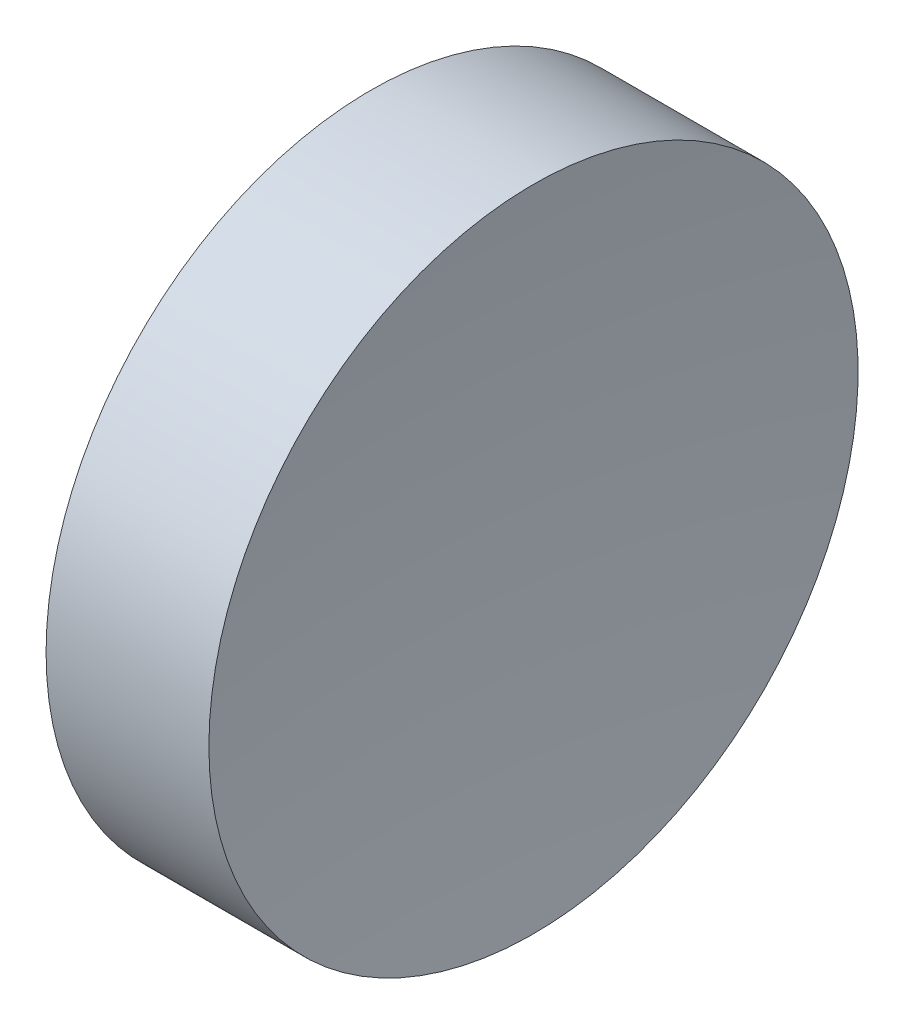
ISO-10303-21;
HEADER;
FILE_DESCRIPTION(('STEP AP214'),'2;1');
FILE_NAME('part.step','',(''),(''),'','','');
FILE_SCHEMA(('AUTOMOTIVE_DESIGN { 1 0 10303 214 1 1 1 1 }'));
ENDSEC;
DATA;
#1=APPLICATION_CONTEXT('core data for automotive mechanical design processes');
#2=APPLICATION_PROTOCOL_DEFINITION('international standard','automotive_design',2000,#1);
#3=PRODUCT_CONTEXT('',#1,'mechanical');
#4=PRODUCT('Part','Part','',(#3));
#5=PRODUCT_RELATED_PRODUCT_CATEGORY('part','',(#4));
#6=PRODUCT_DEFINITION_FORMATION('','',#4);
#7=PRODUCT_DEFINITION_CONTEXT('part definition',#1,'design');
#8=PRODUCT_DEFINITION('design','',#6,#7);
#9=PRODUCT_DEFINITION_SHAPE('','',#8);
#10=(LENGTH_UNIT() NAMED_UNIT(*) SI_UNIT(.MILLI.,.METRE.));
#11=(NAMED_UNIT(*) PLANE_ANGLE_UNIT() SI_UNIT($,.RADIAN.));
#12=(NAMED_UNIT(*) SI_UNIT($,.STERADIAN.) SOLID_ANGLE_UNIT());
#13=UNCERTAINTY_MEASURE_WITH_UNIT(LENGTH_MEASURE(1.E-05),#10,'distance_accuracy_value','');
#14=(GEOMETRIC_REPRESENTATION_CONTEXT(3) GLOBAL_UNCERTAINTY_ASSIGNED_CONTEXT((#13)) GLOBAL_UNIT_ASSIGNED_CONTEXT((#10,
#11,#12)) REPRESENTATION_CONTEXT('',''));
#15=CARTESIAN_POINT('',(0.,0.,0.));
#16=DIRECTION('',(0.,0.,1.));
#17=DIRECTION('',(1.,0.,0.));
#18=AXIS2_PLACEMENT_3D('',#15,#16,#17);
#19=CARTESIAN_POINT('',(0.,0.,0.));
#20=DIRECTION('',(1.,0.,0.));
#21=DIRECTION('',(0.,0.,-1.));
#22=AXIS2_PLACEMENT_3D('',#19,#20,#21);
#23=PLANE('',#22);
#24=CARTESIAN_POINT('',(0.,0.,0.));
#25=DIRECTION('',(-1.,0.,0.));
#26=DIRECTION('',(0.,0.,1.));
#27=AXIS2_PLACEMENT_3D('',#24,#25,#26);
#28=CIRCLE('',#27,6.35);
#29=CARTESIAN_POINT('',(0.,0.,6.35));
#30=VERTEX_POINT('',#29);
#31=EDGE_CURVE('E39',#30,#30,#28,.T.);
#32=ORIENTED_EDGE('',*,*,#31,.T.);
#33=EDGE_LOOP('',(#32));
#34=FACE_BOUND('',#33,.T.);
#35=ADVANCED_FACE('F33',(#34),#23,.F.);
#36=CARTESIAN_POINT('',(52.78,0.,0.));
#37=DIRECTION('',(-1.,0.,0.));
#38=DIRECTION('',(0.,0.,1.));
#39=AXIS2_PLACEMENT_3D('',#36,#37,#38);
#40=SPHERICAL_SURFACE('',#39,50.);
#41=CARTESIAN_POINT('',(3.18486414979791,0.,0.));
#42=DIRECTION('',(-1.,0.,0.));
#43=DIRECTION('',(0.,0.,1.));
#44=AXIS2_PLACEMENT_3D('',#41,#42,#43);
#45=CIRCLE('',#44,6.35000000000001);
#46=CARTESIAN_POINT('',(3.18486414979791,0.,6.35000000000001));
#47=VERTEX_POINT('',#46);
#48=EDGE_CURVE('E10',#47,#47,#45,.T.);
#49=ORIENTED_EDGE('',*,*,#48,.F.);
#50=EDGE_LOOP('',(#49));
#51=FACE_BOUND('',#50,.T.);
#52=ADVANCED_FACE('F48',(#51),#40,.F.);
#53=CARTESIAN_POINT('',(0.,0.,0.));
#54=DIRECTION('',(-1.,0.,0.));
#55=DIRECTION('',(0.,0.,1.));
#56=AXIS2_PLACEMENT_3D('',#53,#54,#55);
#57=CYLINDRICAL_SURFACE('',#56,6.35000000000001);
#58=ORIENTED_EDGE('',*,*,#31,.F.);
#59=EDGE_LOOP('',(#58));
#60=FACE_BOUND('',#59,.T.);
#61=ORIENTED_EDGE('',*,*,#48,.T.);
#62=EDGE_LOOP('',(#61));
#63=FACE_BOUND('',#62,.T.);
#64=ADVANCED_FACE('F46',(#60,#63),#57,.T.);
#65=CLOSED_SHELL('',(#35,#52,#64));
#66=MANIFOLD_SOLID_BREP('B2',#65);
#67=ADVANCED_BREP_SHAPE_REPRESENTATION('',(#18,#66),#14);
#68=SHAPE_DEFINITION_REPRESENTATION(#9,#67);
ENDSEC;
END-ISO-10303-21;
